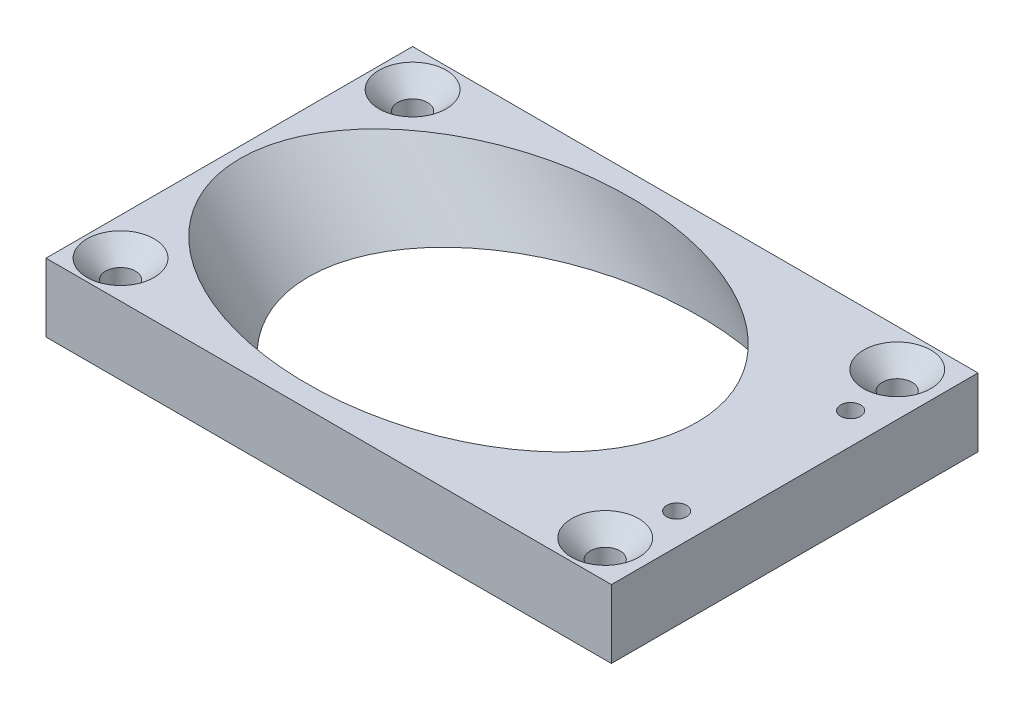
ISO-10303-21;
HEADER;
FILE_DESCRIPTION(('STEP AP214'),'2;1');
FILE_NAME('part.step','',(''),(''),'','','');
FILE_SCHEMA(('AUTOMOTIVE_DESIGN { 1 0 10303 214 1 1 1 1 }'));
ENDSEC;
DATA;
#1=APPLICATION_CONTEXT('core data for automotive mechanical design processes');
#2=APPLICATION_PROTOCOL_DEFINITION('international standard','automotive_design',2000,#1);
#3=PRODUCT_CONTEXT('',#1,'mechanical');
#4=PRODUCT('Part','Part','',(#3));
#5=PRODUCT_RELATED_PRODUCT_CATEGORY('part','',(#4));
#6=PRODUCT_DEFINITION_FORMATION('','',#4);
#7=PRODUCT_DEFINITION_CONTEXT('part definition',#1,'design');
#8=PRODUCT_DEFINITION('design','',#6,#7);
#9=PRODUCT_DEFINITION_SHAPE('','',#8);
#10=(LENGTH_UNIT() NAMED_UNIT(*) SI_UNIT(.MILLI.,.METRE.));
#11=(NAMED_UNIT(*) PLANE_ANGLE_UNIT() SI_UNIT($,.RADIAN.));
#12=(NAMED_UNIT(*) SI_UNIT($,.STERADIAN.) SOLID_ANGLE_UNIT());
#13=UNCERTAINTY_MEASURE_WITH_UNIT(LENGTH_MEASURE(1.E-05),#10,'distance_accuracy_value','');
#14=(GEOMETRIC_REPRESENTATION_CONTEXT(3) GLOBAL_UNCERTAINTY_ASSIGNED_CONTEXT((#13)) GLOBAL_UNIT_ASSIGNED_CONTEXT((#10,
#11,#12)) REPRESENTATION_CONTEXT('',''));
#15=CARTESIAN_POINT('',(0.,0.,0.));
#16=DIRECTION('',(0.,0.,1.));
#17=DIRECTION('',(1.,0.,0.));
#18=AXIS2_PLACEMENT_3D('',#15,#16,#17);
#19=CARTESIAN_POINT('',(22.75,5.5,14.75));
#20=DIRECTION('',(-1.,0.,0.));
#21=DIRECTION('',(0.,0.,1.));
#22=AXIS2_PLACEMENT_3D('',#19,#20,#21);
#23=PLANE('',#22);
#24=DIRECTION('',(0.,0.,-1.));
#25=VECTOR('',#24,1.);
#26=CARTESIAN_POINT('',(22.75,0.,14.75));
#27=LINE('',#26,#25);
#28=CARTESIAN_POINT('',(22.75,0.,14.75));
#29=VERTEX_POINT('',#28);
#30=CARTESIAN_POINT('',(22.75,0.,-14.75));
#31=VERTEX_POINT('',#30);
#32=EDGE_CURVE('E99',#29,#31,#27,.T.);
#33=ORIENTED_EDGE('',*,*,#32,.T.);
#34=DIRECTION('',(0.,-1.,0.));
#35=VECTOR('',#34,1.);
#36=CARTESIAN_POINT('',(22.75,5.5,-14.75));
#37=LINE('',#36,#35);
#38=CARTESIAN_POINT('',(22.75,5.5,-14.75));
#39=VERTEX_POINT('',#38);
#40=EDGE_CURVE('E11',#39,#31,#37,.T.);
#41=ORIENTED_EDGE('',*,*,#40,.F.);
#42=DIRECTION('',(0.,0.,-1.));
#43=VECTOR('',#42,1.);
#44=CARTESIAN_POINT('',(22.75,5.5,14.75));
#45=LINE('',#44,#43);
#46=CARTESIAN_POINT('',(22.75,5.5,14.75));
#47=VERTEX_POINT('',#46);
#48=EDGE_CURVE('E87',#47,#39,#45,.T.);
#49=ORIENTED_EDGE('',*,*,#48,.F.);
#50=DIRECTION('',(0.,-1.,0.));
#51=VECTOR('',#50,1.);
#52=CARTESIAN_POINT('',(22.75,5.5,14.75));
#53=LINE('',#52,#51);
#54=EDGE_CURVE('E95',#47,#29,#53,.T.);
#55=ORIENTED_EDGE('',*,*,#54,.T.);
#56=EDGE_LOOP('',(#33,#41,#49,#55));
#57=FACE_BOUND('',#56,.T.);
#58=ADVANCED_FACE('F36',(#57),#23,.F.);
#59=CARTESIAN_POINT('',(-22.75,5.5,-14.75));
#60=DIRECTION('',(0.,0.,1.));
#61=DIRECTION('',(1.,0.,0.));
#62=AXIS2_PLACEMENT_3D('',#59,#60,#61);
#63=PLANE('',#62);
#64=DIRECTION('',(-1.,0.,0.));
#65=VECTOR('',#64,1.);
#66=CARTESIAN_POINT('',(-22.75,0.,-14.75));
#67=LINE('',#66,#65);
#68=CARTESIAN_POINT('',(-22.75,0.,-14.75));
#69=VERTEX_POINT('',#68);
#70=EDGE_CURVE('E91',#31,#69,#67,.T.);
#71=ORIENTED_EDGE('',*,*,#70,.T.);
#72=DIRECTION('',(0.,-1.,0.));
#73=VECTOR('',#72,1.);
#74=CARTESIAN_POINT('',(-22.75,5.5,-14.75));
#75=LINE('',#74,#73);
#76=CARTESIAN_POINT('',(-22.75,5.5,-14.75));
#77=VERTEX_POINT('',#76);
#78=EDGE_CURVE('E44',#77,#69,#75,.T.);
#79=ORIENTED_EDGE('',*,*,#78,.F.);
#80=DIRECTION('',(-1.,0.,0.));
#81=VECTOR('',#80,1.);
#82=CARTESIAN_POINT('',(-22.75,5.5,-14.75));
#83=LINE('',#82,#81);
#84=EDGE_CURVE('E82',#39,#77,#83,.T.);
#85=ORIENTED_EDGE('',*,*,#84,.F.);
#86=ORIENTED_EDGE('',*,*,#40,.T.);
#87=EDGE_LOOP('',(#71,#79,#85,#86));
#88=FACE_BOUND('',#87,.T.);
#89=ADVANCED_FACE('F90',(#88),#63,.F.);
#90=CARTESIAN_POINT('',(-22.75,5.5,14.75));
#91=DIRECTION('',(1.,0.,0.));
#92=DIRECTION('',(0.,0.,-1.));
#93=AXIS2_PLACEMENT_3D('',#90,#91,#92);
#94=PLANE('',#93);
#95=DIRECTION('',(0.,0.,1.));
#96=VECTOR('',#95,1.);
#97=CARTESIAN_POINT('',(-22.75,0.,14.75));
#98=LINE('',#97,#96);
#99=CARTESIAN_POINT('',(-22.75,0.,14.75));
#100=VERTEX_POINT('',#99);
#101=EDGE_CURVE('E69',#69,#100,#98,.T.);
#102=ORIENTED_EDGE('',*,*,#101,.T.);
#103=DIRECTION('',(0.,-1.,0.));
#104=VECTOR('',#103,1.);
#105=CARTESIAN_POINT('',(-22.75,5.5,14.75));
#106=LINE('',#105,#104);
#107=CARTESIAN_POINT('',(-22.75,5.5,14.75));
#108=VERTEX_POINT('',#107);
#109=EDGE_CURVE('E92',#108,#100,#106,.T.);
#110=ORIENTED_EDGE('',*,*,#109,.F.);
#111=DIRECTION('',(0.,0.,1.));
#112=VECTOR('',#111,1.);
#113=CARTESIAN_POINT('',(-22.75,5.5,14.75));
#114=LINE('',#113,#112);
#115=EDGE_CURVE('E85',#77,#108,#114,.T.);
#116=ORIENTED_EDGE('',*,*,#115,.F.);
#117=ORIENTED_EDGE('',*,*,#78,.T.);
#118=EDGE_LOOP('',(#102,#110,#116,#117));
#119=FACE_BOUND('',#118,.T.);
#120=ADVANCED_FACE('F93',(#119),#94,.F.);
#121=CARTESIAN_POINT('',(-22.75,5.5,14.75));
#122=DIRECTION('',(0.,0.,-1.));
#123=DIRECTION('',(-1.,0.,0.));
#124=AXIS2_PLACEMENT_3D('',#121,#122,#123);
#125=PLANE('',#124);
#126=DIRECTION('',(1.,0.,0.));
#127=VECTOR('',#126,1.);
#128=CARTESIAN_POINT('',(-22.75,0.,14.75));
#129=LINE('',#128,#127);
#130=EDGE_CURVE('E75',#100,#29,#129,.T.);
#131=ORIENTED_EDGE('',*,*,#130,.T.);
#132=ORIENTED_EDGE('',*,*,#54,.F.);
#133=DIRECTION('',(1.,0.,0.));
#134=VECTOR('',#133,1.);
#135=CARTESIAN_POINT('',(-22.75,5.5,14.75));
#136=LINE('',#135,#134);
#137=EDGE_CURVE('E52',#108,#47,#136,.T.);
#138=ORIENTED_EDGE('',*,*,#137,.F.);
#139=ORIENTED_EDGE('',*,*,#109,.T.);
#140=EDGE_LOOP('',(#131,#132,#138,#139));
#141=FACE_BOUND('',#140,.T.);
#142=ADVANCED_FACE('F107',(#141),#125,.F.);
#143=CARTESIAN_POINT('',(0.,5.5,0.));
#144=DIRECTION('',(0.,-1.,0.));
#145=DIRECTION('',(0.,0.,-1.));
#146=AXIS2_PLACEMENT_3D('',#143,#144,#145);
#147=PLANE('',#146);
#148=CARTESIAN_POINT('',(20.25,5.5,-7.));
#149=DIRECTION('',(0.,1.,0.));
#150=DIRECTION('',(0.,0.,1.));
#151=AXIS2_PLACEMENT_3D('',#148,#149,#150);
#152=CIRCLE('',#151,0.799999999999988);
#153=CARTESIAN_POINT('',(20.25,5.5,-6.20000000000001));
#154=VERTEX_POINT('',#153);
#155=EDGE_CURVE('E163',#154,#154,#152,.T.);
#156=ORIENTED_EDGE('',*,*,#155,.F.);
#157=EDGE_LOOP('',(#156));
#158=FACE_BOUND('',#157,.T.);
#159=CARTESIAN_POINT('',(20.25,5.5,7.));
#160=DIRECTION('',(0.,1.,0.));
#161=DIRECTION('',(0.,0.,1.));
#162=AXIS2_PLACEMENT_3D('',#159,#160,#161);
#163=CIRCLE('',#162,0.799999999999988);
#164=CARTESIAN_POINT('',(20.25,5.5,7.79999999999999));
#165=VERTEX_POINT('',#164);
#166=EDGE_CURVE('E157',#165,#165,#163,.T.);
#167=ORIENTED_EDGE('',*,*,#166,.F.);
#168=EDGE_LOOP('',(#167));
#169=FACE_BOUND('',#168,.T.);
#170=CARTESIAN_POINT('',(-19.75,5.5,-11.75));
#171=DIRECTION('',(0.,1.,0.));
#172=DIRECTION('',(0.,0.,1.));
#173=AXIS2_PLACEMENT_3D('',#170,#171,#172);
#174=CIRCLE('',#173,2.7);
#175=CARTESIAN_POINT('',(-19.75,5.5,-9.05));
#176=VERTEX_POINT('',#175);
#177=EDGE_CURVE('E151',#176,#176,#174,.T.);
#178=ORIENTED_EDGE('',*,*,#177,.F.);
#179=EDGE_LOOP('',(#178));
#180=FACE_BOUND('',#179,.T.);
#181=CARTESIAN_POINT('',(19.25,5.5,-11.75));
#182=DIRECTION('',(0.,1.,0.));
#183=DIRECTION('',(0.,0.,1.));
#184=AXIS2_PLACEMENT_3D('',#181,#182,#183);
#185=CIRCLE('',#184,2.7);
#186=CARTESIAN_POINT('',(19.25,5.5,-9.05));
#187=VERTEX_POINT('',#186);
#188=EDGE_CURVE('E142',#187,#187,#185,.T.);
#189=ORIENTED_EDGE('',*,*,#188,.F.);
#190=EDGE_LOOP('',(#189));
#191=FACE_BOUND('',#190,.T.);
#192=CARTESIAN_POINT('',(-19.75,5.5,11.75));
#193=DIRECTION('',(0.,1.,0.));
#194=DIRECTION('',(0.,0.,1.));
#195=AXIS2_PLACEMENT_3D('',#192,#193,#194);
#196=CIRCLE('',#195,2.7);
#197=CARTESIAN_POINT('',(-19.75,5.5,14.45));
#198=VERTEX_POINT('',#197);
#199=EDGE_CURVE('E133',#198,#198,#196,.T.);
#200=ORIENTED_EDGE('',*,*,#199,.F.);
#201=EDGE_LOOP('',(#200));
#202=FACE_BOUND('',#201,.T.);
#203=CARTESIAN_POINT('',(19.25,5.5,11.75));
#204=DIRECTION('',(0.,1.,0.));
#205=DIRECTION('',(0.,0.,1.));
#206=AXIS2_PLACEMENT_3D('',#203,#204,#205);
#207=CIRCLE('',#206,2.7);
#208=CARTESIAN_POINT('',(19.25,5.5,14.45));
#209=VERTEX_POINT('',#208);
#210=EDGE_CURVE('E124',#209,#209,#207,.T.);
#211=ORIENTED_EDGE('',*,*,#210,.F.);
#212=EDGE_LOOP('',(#211));
#213=FACE_BOUND('',#212,.T.);
#214=CARTESIAN_POINT('',(-3.50126265847082,5.5,0.));
#215=DIRECTION('',(0.,-1.,0.));
#216=DIRECTION('',(-1.,0.,0.));
#217=AXIS2_PLACEMENT_3D('',#214,#215,#216);
#218=ELLIPSE('',#217,18.3847763108503,13.);
#219=CARTESIAN_POINT('',(-21.8860389693211,5.5,0.));
#220=VERTEX_POINT('',#219);
#221=EDGE_CURVE('E102',#220,#220,#218,.F.);
#222=ORIENTED_EDGE('',*,*,#221,.F.);
#223=EDGE_LOOP('',(#222));
#224=FACE_BOUND('',#223,.T.);
#225=ORIENTED_EDGE('',*,*,#48,.T.);
#226=ORIENTED_EDGE('',*,*,#84,.T.);
#227=ORIENTED_EDGE('',*,*,#115,.T.);
#228=ORIENTED_EDGE('',*,*,#137,.T.);
#229=EDGE_LOOP('',(#225,#226,#227,#228));
#230=FACE_BOUND('',#229,.T.);
#231=ADVANCED_FACE('F83',(#158,#169,#180,#191,#202,#213,#224,#230),#147,.F.);
#232=CARTESIAN_POINT('',(0.,0.,0.));
#233=DIRECTION('',(0.,-1.,0.));
#234=DIRECTION('',(0.,0.,-1.));
#235=AXIS2_PLACEMENT_3D('',#232,#233,#234);
#236=PLANE('',#235);
#237=CARTESIAN_POINT('',(20.25,0.,-7.));
#238=DIRECTION('',(0.,1.,0.));
#239=DIRECTION('',(0.,0.,1.));
#240=AXIS2_PLACEMENT_3D('',#237,#238,#239);
#241=CIRCLE('',#240,0.799999999999995);
#242=CARTESIAN_POINT('',(20.25,0.,-6.2));
#243=VERTEX_POINT('',#242);
#244=EDGE_CURVE('E160',#243,#243,#241,.T.);
#245=ORIENTED_EDGE('',*,*,#244,.T.);
#246=EDGE_LOOP('',(#245));
#247=FACE_BOUND('',#246,.T.);
#248=CARTESIAN_POINT('',(20.25,0.,7.));
#249=DIRECTION('',(0.,1.,0.));
#250=DIRECTION('',(0.,0.,1.));
#251=AXIS2_PLACEMENT_3D('',#248,#249,#250);
#252=CIRCLE('',#251,0.799999999999995);
#253=CARTESIAN_POINT('',(20.25,0.,7.8));
#254=VERTEX_POINT('',#253);
#255=EDGE_CURVE('E154',#254,#254,#252,.T.);
#256=ORIENTED_EDGE('',*,*,#255,.T.);
#257=EDGE_LOOP('',(#256));
#258=FACE_BOUND('',#257,.T.);
#259=CARTESIAN_POINT('',(-19.75,0.,-11.75));
#260=DIRECTION('',(0.,1.,0.));
#261=DIRECTION('',(0.,0.,1.));
#262=AXIS2_PLACEMENT_3D('',#259,#260,#261);
#263=CIRCLE('',#262,1.2);
#264=CARTESIAN_POINT('',(-19.75,0.,-10.55));
#265=VERTEX_POINT('',#264);
#266=EDGE_CURVE('E145',#265,#265,#263,.T.);
#267=ORIENTED_EDGE('',*,*,#266,.T.);
#268=EDGE_LOOP('',(#267));
#269=FACE_BOUND('',#268,.T.);
#270=CARTESIAN_POINT('',(19.25,0.,-11.75));
#271=DIRECTION('',(0.,1.,0.));
#272=DIRECTION('',(0.,0.,1.));
#273=AXIS2_PLACEMENT_3D('',#270,#271,#272);
#274=CIRCLE('',#273,1.2);
#275=CARTESIAN_POINT('',(19.25,0.,-10.55));
#276=VERTEX_POINT('',#275);
#277=EDGE_CURVE('E136',#276,#276,#274,.T.);
#278=ORIENTED_EDGE('',*,*,#277,.T.);
#279=EDGE_LOOP('',(#278));
#280=FACE_BOUND('',#279,.T.);
#281=CARTESIAN_POINT('',(-19.75,0.,11.75));
#282=DIRECTION('',(0.,1.,0.));
#283=DIRECTION('',(0.,0.,1.));
#284=AXIS2_PLACEMENT_3D('',#281,#282,#283);
#285=CIRCLE('',#284,1.2);
#286=CARTESIAN_POINT('',(-19.75,0.,12.95));
#287=VERTEX_POINT('',#286);
#288=EDGE_CURVE('E127',#287,#287,#285,.T.);
#289=ORIENTED_EDGE('',*,*,#288,.T.);
#290=EDGE_LOOP('',(#289));
#291=FACE_BOUND('',#290,.T.);
#292=CARTESIAN_POINT('',(19.25,0.,11.75));
#293=DIRECTION('',(0.,1.,0.));
#294=DIRECTION('',(0.,0.,1.));
#295=AXIS2_PLACEMENT_3D('',#292,#293,#294);
#296=CIRCLE('',#295,1.2);
#297=CARTESIAN_POINT('',(19.25,0.,12.95));
#298=VERTEX_POINT('',#297);
#299=EDGE_CURVE('E118',#298,#298,#296,.T.);
#300=ORIENTED_EDGE('',*,*,#299,.T.);
#301=EDGE_LOOP('',(#300));
#302=FACE_BOUND('',#301,.T.);
#303=CARTESIAN_POINT('',(1.9987373415292,0.,0.));
#304=DIRECTION('',(0.,-1.,0.));
#305=DIRECTION('',(-1.,0.,0.));
#306=AXIS2_PLACEMENT_3D('',#303,#304,#305);
#307=ELLIPSE('',#306,18.3847763108503,13.);
#308=CARTESIAN_POINT('',(-16.3860389693211,0.,0.));
#309=VERTEX_POINT('',#308);
#310=EDGE_CURVE('E115',#309,#309,#307,.F.);
#311=ORIENTED_EDGE('',*,*,#310,.T.);
#312=EDGE_LOOP('',(#311));
#313=FACE_BOUND('',#312,.T.);
#314=ORIENTED_EDGE('',*,*,#32,.F.);
#315=ORIENTED_EDGE('',*,*,#130,.F.);
#316=ORIENTED_EDGE('',*,*,#101,.F.);
#317=ORIENTED_EDGE('',*,*,#70,.F.);
#318=EDGE_LOOP('',(#314,#315,#316,#317));
#319=FACE_BOUND('',#318,.T.);
#320=ADVANCED_FACE('F110',(#247,#258,#269,#280,#291,#302,#313,#319),#236,.T.);
#321=CARTESIAN_POINT('',(12.3753686707646,-10.3766313292354,0.));
#322=DIRECTION('',(-0.707106781186549,0.707106781186546,0.));
#323=DIRECTION('',(-0.707106781186546,-0.707106781186549,0.));
#324=AXIS2_PLACEMENT_3D('',#321,#322,#323);
#325=CYLINDRICAL_SURFACE('',#324,13.);
#326=ORIENTED_EDGE('',*,*,#310,.F.);
#327=EDGE_LOOP('',(#326));
#328=FACE_BOUND('',#327,.T.);
#329=ORIENTED_EDGE('',*,*,#221,.T.);
#330=EDGE_LOOP('',(#329));
#331=FACE_BOUND('',#330,.T.);
#332=ADVANCED_FACE('F184',(#328,#331),#325,.F.);
#333=CARTESIAN_POINT('',(19.25,5.5,11.75));
#334=DIRECTION('',(0.,1.,0.));
#335=DIRECTION('',(0.,0.,1.));
#336=AXIS2_PLACEMENT_3D('',#333,#334,#335);
#337=CYLINDRICAL_SURFACE('',#336,1.19999999999999);
#338=ORIENTED_EDGE('',*,*,#299,.F.);
#339=EDGE_LOOP('',(#338));
#340=FACE_BOUND('',#339,.T.);
#341=CARTESIAN_POINT('',(19.25,4.,11.75));
#342=DIRECTION('',(0.,1.,0.));
#343=DIRECTION('',(0.,0.,1.));
#344=AXIS2_PLACEMENT_3D('',#341,#342,#343);
#345=CIRCLE('',#344,1.19999999999999);
#346=CARTESIAN_POINT('',(19.25,4.,12.95));
#347=VERTEX_POINT('',#346);
#348=EDGE_CURVE('E121',#347,#347,#345,.T.);
#349=ORIENTED_EDGE('',*,*,#348,.T.);
#350=EDGE_LOOP('',(#349));
#351=FACE_BOUND('',#350,.T.);
#352=ADVANCED_FACE('F186',(#340,#351),#337,.F.);
#353=CARTESIAN_POINT('',(19.25,5.5,11.75));
#354=DIRECTION('',(0.,1.,0.));
#355=DIRECTION('',(0.,0.,1.));
#356=AXIS2_PLACEMENT_3D('',#353,#354,#355);
#357=CONICAL_SURFACE('',#356,2.7,0.785398163397452);
#358=ORIENTED_EDGE('',*,*,#348,.F.);
#359=EDGE_LOOP('',(#358));
#360=FACE_BOUND('',#359,.T.);
#361=ORIENTED_EDGE('',*,*,#210,.T.);
#362=EDGE_LOOP('',(#361));
#363=FACE_BOUND('',#362,.T.);
#364=ADVANCED_FACE('F193',(#360,#363),#357,.F.);
#365=CARTESIAN_POINT('',(-19.75,5.5,11.75));
#366=DIRECTION('',(0.,1.,0.));
#367=DIRECTION('',(0.,0.,1.));
#368=AXIS2_PLACEMENT_3D('',#365,#366,#367);
#369=CYLINDRICAL_SURFACE('',#368,1.19999999999999);
#370=ORIENTED_EDGE('',*,*,#288,.F.);
#371=EDGE_LOOP('',(#370));
#372=FACE_BOUND('',#371,.T.);
#373=CARTESIAN_POINT('',(-19.75,4.,11.75));
#374=DIRECTION('',(0.,1.,0.));
#375=DIRECTION('',(0.,0.,1.));
#376=AXIS2_PLACEMENT_3D('',#373,#374,#375);
#377=CIRCLE('',#376,1.19999999999999);
#378=CARTESIAN_POINT('',(-19.75,4.,12.95));
#379=VERTEX_POINT('',#378);
#380=EDGE_CURVE('E130',#379,#379,#377,.T.);
#381=ORIENTED_EDGE('',*,*,#380,.T.);
#382=EDGE_LOOP('',(#381));
#383=FACE_BOUND('',#382,.T.);
#384=ADVANCED_FACE('F286',(#372,#383),#369,.F.);
#385=CARTESIAN_POINT('',(-19.75,5.5,11.75));
#386=DIRECTION('',(0.,1.,0.));
#387=DIRECTION('',(0.,0.,1.));
#388=AXIS2_PLACEMENT_3D('',#385,#386,#387);
#389=CONICAL_SURFACE('',#388,2.7,0.785398163397452);
#390=ORIENTED_EDGE('',*,*,#380,.F.);
#391=EDGE_LOOP('',(#390));
#392=FACE_BOUND('',#391,.T.);
#393=ORIENTED_EDGE('',*,*,#199,.T.);
#394=EDGE_LOOP('',(#393));
#395=FACE_BOUND('',#394,.T.);
#396=ADVANCED_FACE('F278',(#392,#395),#389,.F.);
#397=CARTESIAN_POINT('',(19.25,5.5,-11.75));
#398=DIRECTION('',(0.,1.,0.));
#399=DIRECTION('',(0.,0.,1.));
#400=AXIS2_PLACEMENT_3D('',#397,#398,#399);
#401=CYLINDRICAL_SURFACE('',#400,1.19999999999999);
#402=ORIENTED_EDGE('',*,*,#277,.F.);
#403=EDGE_LOOP('',(#402));
#404=FACE_BOUND('',#403,.T.);
#405=CARTESIAN_POINT('',(19.25,4.,-11.75));
#406=DIRECTION('',(0.,1.,0.));
#407=DIRECTION('',(0.,0.,1.));
#408=AXIS2_PLACEMENT_3D('',#405,#406,#407);
#409=CIRCLE('',#408,1.19999999999999);
#410=CARTESIAN_POINT('',(19.25,4.,-10.55));
#411=VERTEX_POINT('',#410);
#412=EDGE_CURVE('E139',#411,#411,#409,.T.);
#413=ORIENTED_EDGE('',*,*,#412,.T.);
#414=EDGE_LOOP('',(#413));
#415=FACE_BOUND('',#414,.T.);
#416=ADVANCED_FACE('F270',(#404,#415),#401,.F.);
#417=CARTESIAN_POINT('',(19.25,5.5,-11.75));
#418=DIRECTION('',(0.,1.,0.));
#419=DIRECTION('',(0.,0.,1.));
#420=AXIS2_PLACEMENT_3D('',#417,#418,#419);
#421=CONICAL_SURFACE('',#420,2.7,0.785398163397452);
#422=ORIENTED_EDGE('',*,*,#412,.F.);
#423=EDGE_LOOP('',(#422));
#424=FACE_BOUND('',#423,.T.);
#425=ORIENTED_EDGE('',*,*,#188,.T.);
#426=EDGE_LOOP('',(#425));
#427=FACE_BOUND('',#426,.T.);
#428=ADVANCED_FACE('F262',(#424,#427),#421,.F.);
#429=CARTESIAN_POINT('',(-19.75,5.5,-11.75));
#430=DIRECTION('',(0.,1.,0.));
#431=DIRECTION('',(0.,0.,1.));
#432=AXIS2_PLACEMENT_3D('',#429,#430,#431);
#433=CYLINDRICAL_SURFACE('',#432,1.19999999999999);
#434=ORIENTED_EDGE('',*,*,#266,.F.);
#435=EDGE_LOOP('',(#434));
#436=FACE_BOUND('',#435,.T.);
#437=CARTESIAN_POINT('',(-19.75,4.,-11.75));
#438=DIRECTION('',(0.,1.,0.));
#439=DIRECTION('',(0.,0.,1.));
#440=AXIS2_PLACEMENT_3D('',#437,#438,#439);
#441=CIRCLE('',#440,1.19999999999999);
#442=CARTESIAN_POINT('',(-19.75,4.,-10.55));
#443=VERTEX_POINT('',#442);
#444=EDGE_CURVE('E148',#443,#443,#441,.T.);
#445=ORIENTED_EDGE('',*,*,#444,.T.);
#446=EDGE_LOOP('',(#445));
#447=FACE_BOUND('',#446,.T.);
#448=ADVANCED_FACE('F255',(#436,#447),#433,.F.);
#449=CARTESIAN_POINT('',(-19.75,5.5,-11.75));
#450=DIRECTION('',(0.,1.,0.));
#451=DIRECTION('',(0.,0.,1.));
#452=AXIS2_PLACEMENT_3D('',#449,#450,#451);
#453=CONICAL_SURFACE('',#452,2.7,0.785398163397452);
#454=ORIENTED_EDGE('',*,*,#444,.F.);
#455=EDGE_LOOP('',(#454));
#456=FACE_BOUND('',#455,.T.);
#457=ORIENTED_EDGE('',*,*,#177,.T.);
#458=EDGE_LOOP('',(#457));
#459=FACE_BOUND('',#458,.T.);
#460=ADVANCED_FACE('F234',(#456,#459),#453,.F.);
#461=CARTESIAN_POINT('',(20.25,5.5,7.));
#462=DIRECTION('',(0.,1.,0.));
#463=DIRECTION('',(0.,0.,1.));
#464=AXIS2_PLACEMENT_3D('',#461,#462,#463);
#465=CYLINDRICAL_SURFACE('',#464,0.799999999999992);
#466=ORIENTED_EDGE('',*,*,#255,.F.);
#467=EDGE_LOOP('',(#466));
#468=FACE_BOUND('',#467,.T.);
#469=ORIENTED_EDGE('',*,*,#166,.T.);
#470=EDGE_LOOP('',(#469));
#471=FACE_BOUND('',#470,.T.);
#472=ADVANCED_FACE('F228',(#468,#471),#465,.F.);
#473=CARTESIAN_POINT('',(20.25,5.5,-7.));
#474=DIRECTION('',(0.,1.,0.));
#475=DIRECTION('',(0.,0.,1.));
#476=AXIS2_PLACEMENT_3D('',#473,#474,#475);
#477=CYLINDRICAL_SURFACE('',#476,0.799999999999992);
#478=ORIENTED_EDGE('',*,*,#244,.F.);
#479=EDGE_LOOP('',(#478));
#480=FACE_BOUND('',#479,.T.);
#481=ORIENTED_EDGE('',*,*,#155,.T.);
#482=EDGE_LOOP('',(#481));
#483=FACE_BOUND('',#482,.T.);
#484=ADVANCED_FACE('F167',(#480,#483),#477,.F.);
#485=CLOSED_SHELL('',(#58,#89,#120,#142,#231,#320,#332,#352,#364,#384,#396,#416,#428,#448,#460,
#472,#484));
#486=MANIFOLD_SOLID_BREP('B2',#485);
#487=ADVANCED_BREP_SHAPE_REPRESENTATION('',(#18,#486),#14);
#488=SHAPE_DEFINITION_REPRESENTATION(#9,#487);
ENDSEC;
END-ISO-10303-21;
